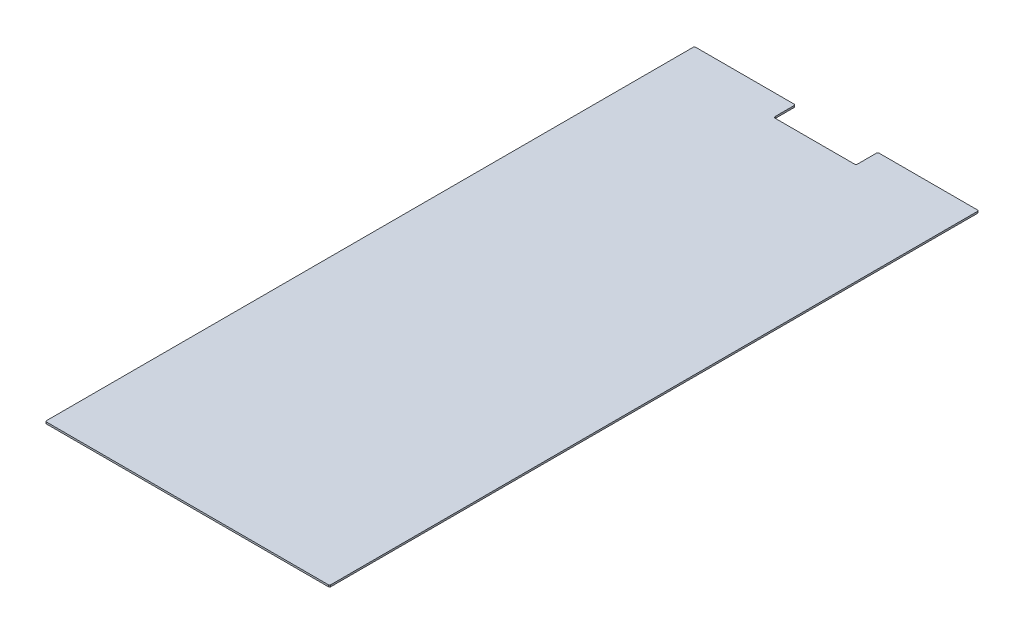
ISO-10303-21;
HEADER;
FILE_DESCRIPTION(('STEP AP214'),'2;1');
FILE_NAME('part.step','',(''),(''),'','','');
FILE_SCHEMA(('AUTOMOTIVE_DESIGN { 1 0 10303 214 1 1 1 1 }'));
ENDSEC;
DATA;
#1=APPLICATION_CONTEXT('core data for automotive mechanical design processes');
#2=APPLICATION_PROTOCOL_DEFINITION('international standard','automotive_design',2000,#1);
#3=PRODUCT_CONTEXT('',#1,'mechanical');
#4=PRODUCT('Part','Part','',(#3));
#5=PRODUCT_RELATED_PRODUCT_CATEGORY('part','',(#4));
#6=PRODUCT_DEFINITION_FORMATION('','',#4);
#7=PRODUCT_DEFINITION_CONTEXT('part definition',#1,'design');
#8=PRODUCT_DEFINITION('design','',#6,#7);
#9=PRODUCT_DEFINITION_SHAPE('','',#8);
#10=(LENGTH_UNIT() NAMED_UNIT(*) SI_UNIT(.MILLI.,.METRE.));
#11=(NAMED_UNIT(*) PLANE_ANGLE_UNIT() SI_UNIT($,.RADIAN.));
#12=(NAMED_UNIT(*) SI_UNIT($,.STERADIAN.) SOLID_ANGLE_UNIT());
#13=UNCERTAINTY_MEASURE_WITH_UNIT(LENGTH_MEASURE(1.E-05),#10,'distance_accuracy_value','');
#14=(GEOMETRIC_REPRESENTATION_CONTEXT(3) GLOBAL_UNCERTAINTY_ASSIGNED_CONTEXT((#13)) GLOBAL_UNIT_ASSIGNED_CONTEXT((#10,
#11,#12)) REPRESENTATION_CONTEXT('',''));
#15=CARTESIAN_POINT('',(0.,0.,0.));
#16=DIRECTION('',(0.,0.,1.));
#17=DIRECTION('',(1.,0.,0.));
#18=AXIS2_PLACEMENT_3D('',#15,#16,#17);
#19=CARTESIAN_POINT('',(-67.,3.,-517.5));
#20=DIRECTION('',(0.,-1.,0.));
#21=DIRECTION('',(0.,0.,-1.));
#22=AXIS2_PLACEMENT_3D('',#19,#20,#21);
#23=CYLINDRICAL_SURFACE('',#22,3.);
#24=CARTESIAN_POINT('',(-67.,0.,-517.5));
#25=DIRECTION('',(0.,-1.,0.));
#26=DIRECTION('',(0.,0.,-1.));
#27=AXIS2_PLACEMENT_3D('',#24,#25,#26);
#28=CIRCLE('',#27,3.);
#29=CARTESIAN_POINT('',(-67.,0.,-514.5));
#30=VERTEX_POINT('',#29);
#31=CARTESIAN_POINT('',(-70.,0.,-517.5));
#32=VERTEX_POINT('',#31);
#33=EDGE_CURVE('E326',#30,#32,#28,.T.);
#34=ORIENTED_EDGE('',*,*,#33,.T.);
#35=DIRECTION('',(0.,-1.,0.));
#36=VECTOR('',#35,1.);
#37=CARTESIAN_POINT('',(-70.,3.,-517.5));
#38=LINE('',#37,#36);
#39=CARTESIAN_POINT('',(-70.,3.,-517.5));
#40=VERTEX_POINT('',#39);
#41=EDGE_CURVE('E12',#40,#32,#38,.T.);
#42=ORIENTED_EDGE('',*,*,#41,.F.);
#43=CARTESIAN_POINT('',(-67.,3.,-517.5));
#44=DIRECTION('',(0.,-1.,0.));
#45=DIRECTION('',(0.,0.,-1.));
#46=AXIS2_PLACEMENT_3D('',#43,#44,#45);
#47=CIRCLE('',#46,3.);
#48=CARTESIAN_POINT('',(-67.,3.,-514.5));
#49=VERTEX_POINT('',#48);
#50=EDGE_CURVE('E248',#49,#40,#47,.T.);
#51=ORIENTED_EDGE('',*,*,#50,.F.);
#52=DIRECTION('',(0.,-1.,0.));
#53=VECTOR('',#52,1.);
#54=CARTESIAN_POINT('',(-67.,3.,-514.5));
#55=LINE('',#54,#53);
#56=EDGE_CURVE('E185',#49,#30,#55,.T.);
#57=ORIENTED_EDGE('',*,*,#56,.T.);
#58=EDGE_LOOP('',(#34,#42,#51,#57));
#59=FACE_BOUND('',#58,.T.);
#60=ADVANCED_FACE('F40',(#59),#23,.F.);
#61=CARTESIAN_POINT('',(-70.,3.,-517.5));
#62=DIRECTION('',(-1.,0.,0.));
#63=DIRECTION('',(0.,0.,1.));
#64=AXIS2_PLACEMENT_3D('',#61,#62,#63);
#65=PLANE('',#64);
#66=DIRECTION('',(0.,0.,-1.));
#67=VECTOR('',#66,1.);
#68=CARTESIAN_POINT('',(-70.,0.,-517.5));
#69=LINE('',#68,#67);
#70=CARTESIAN_POINT('',(-70.,0.,-549.5));
#71=VERTEX_POINT('',#70);
#72=EDGE_CURVE('E317',#32,#71,#69,.T.);
#73=ORIENTED_EDGE('',*,*,#72,.T.);
#74=DIRECTION('',(0.,-1.,0.));
#75=VECTOR('',#74,1.);
#76=CARTESIAN_POINT('',(-70.,3.,-549.5));
#77=LINE('',#76,#75);
#78=CARTESIAN_POINT('',(-70.,3.,-549.5));
#79=VERTEX_POINT('',#78);
#80=EDGE_CURVE('E49',#79,#71,#77,.T.);
#81=ORIENTED_EDGE('',*,*,#80,.F.);
#82=DIRECTION('',(0.,0.,-1.));
#83=VECTOR('',#82,1.);
#84=CARTESIAN_POINT('',(-70.,3.,-517.5));
#85=LINE('',#84,#83);
#86=EDGE_CURVE('E124',#40,#79,#85,.T.);
#87=ORIENTED_EDGE('',*,*,#86,.F.);
#88=ORIENTED_EDGE('',*,*,#41,.T.);
#89=EDGE_LOOP('',(#73,#81,#87,#88));
#90=FACE_BOUND('',#89,.T.);
#91=ADVANCED_FACE('F374',(#90),#65,.F.);
#92=CARTESIAN_POINT('',(-72.,3.,-549.5));
#93=DIRECTION('',(0.,-1.,0.));
#94=DIRECTION('',(0.,0.,-1.));
#95=AXIS2_PLACEMENT_3D('',#92,#93,#94);
#96=CYLINDRICAL_SURFACE('',#95,2.);
#97=CARTESIAN_POINT('',(-72.,0.,-549.5));
#98=DIRECTION('',(0.,1.,0.));
#99=DIRECTION('',(0.,0.,1.));
#100=AXIS2_PLACEMENT_3D('',#97,#98,#99);
#101=CIRCLE('',#100,2.);
#102=CARTESIAN_POINT('',(-72.,0.,-551.5));
#103=VERTEX_POINT('',#102);
#104=EDGE_CURVE('E312',#71,#103,#101,.T.);
#105=ORIENTED_EDGE('',*,*,#104,.T.);
#106=DIRECTION('',(0.,-1.,0.));
#107=VECTOR('',#106,1.);
#108=CARTESIAN_POINT('',(-72.,3.,-551.5));
#109=LINE('',#108,#107);
#110=CARTESIAN_POINT('',(-72.,3.,-551.5));
#111=VERTEX_POINT('',#110);
#112=EDGE_CURVE('E302',#111,#103,#109,.T.);
#113=ORIENTED_EDGE('',*,*,#112,.F.);
#114=CARTESIAN_POINT('',(-72.,3.,-549.5));
#115=DIRECTION('',(0.,1.,0.));
#116=DIRECTION('',(0.,0.,1.));
#117=AXIS2_PLACEMENT_3D('',#114,#115,#116);
#118=CIRCLE('',#117,2.);
#119=EDGE_CURVE('E240',#79,#111,#118,.T.);
#120=ORIENTED_EDGE('',*,*,#119,.F.);
#121=ORIENTED_EDGE('',*,*,#80,.T.);
#122=EDGE_LOOP('',(#105,#113,#120,#121));
#123=FACE_BOUND('',#122,.T.);
#124=ADVANCED_FACE('F310',(#123),#96,.T.);
#125=CARTESIAN_POINT('',(-72.,3.,-551.5));
#126=DIRECTION('',(0.,0.,1.));
#127=DIRECTION('',(1.,0.,0.));
#128=AXIS2_PLACEMENT_3D('',#125,#126,#127);
#129=PLANE('',#128);
#130=DIRECTION('',(-1.,0.,0.));
#131=VECTOR('',#130,1.);
#132=CARTESIAN_POINT('',(-72.,0.,-551.5));
#133=LINE('',#132,#131);
#134=CARTESIAN_POINT('',(-239.5,0.,-551.5));
#135=VERTEX_POINT('',#134);
#136=EDGE_CURVE('E319',#103,#135,#133,.T.);
#137=ORIENTED_EDGE('',*,*,#136,.T.);
#138=DIRECTION('',(0.,-1.,0.));
#139=VECTOR('',#138,1.);
#140=CARTESIAN_POINT('',(-239.5,3.,-551.5));
#141=LINE('',#140,#139);
#142=CARTESIAN_POINT('',(-239.5,3.,-551.5));
#143=VERTEX_POINT('',#142);
#144=EDGE_CURVE('E298',#143,#135,#141,.T.);
#145=ORIENTED_EDGE('',*,*,#144,.F.);
#146=DIRECTION('',(-1.,0.,0.));
#147=VECTOR('',#146,1.);
#148=CARTESIAN_POINT('',(-72.,3.,-551.5));
#149=LINE('',#148,#147);
#150=EDGE_CURVE('E236',#111,#143,#149,.T.);
#151=ORIENTED_EDGE('',*,*,#150,.F.);
#152=ORIENTED_EDGE('',*,*,#112,.T.);
#153=EDGE_LOOP('',(#137,#145,#151,#152));
#154=FACE_BOUND('',#153,.T.);
#155=ADVANCED_FACE('F381',(#154),#129,.F.);
#156=CARTESIAN_POINT('',(-239.5,3.,-549.5));
#157=DIRECTION('',(0.,-1.,0.));
#158=DIRECTION('',(0.,0.,-1.));
#159=AXIS2_PLACEMENT_3D('',#156,#157,#158);
#160=CYLINDRICAL_SURFACE('',#159,2.);
#161=CARTESIAN_POINT('',(-239.5,0.,-549.5));
#162=DIRECTION('',(0.,1.,0.));
#163=DIRECTION('',(0.,0.,1.));
#164=AXIS2_PLACEMENT_3D('',#161,#162,#163);
#165=CIRCLE('',#164,2.);
#166=CARTESIAN_POINT('',(-241.5,0.,-549.5));
#167=VERTEX_POINT('',#166);
#168=EDGE_CURVE('E324',#135,#167,#165,.T.);
#169=ORIENTED_EDGE('',*,*,#168,.T.);
#170=DIRECTION('',(0.,-1.,0.));
#171=VECTOR('',#170,1.);
#172=CARTESIAN_POINT('',(-241.5,3.,-549.5));
#173=LINE('',#172,#171);
#174=CARTESIAN_POINT('',(-241.5,3.,-549.5));
#175=VERTEX_POINT('',#174);
#176=EDGE_CURVE('E294',#175,#167,#173,.T.);
#177=ORIENTED_EDGE('',*,*,#176,.F.);
#178=CARTESIAN_POINT('',(-239.5,3.,-549.5));
#179=DIRECTION('',(0.,1.,0.));
#180=DIRECTION('',(0.,0.,1.));
#181=AXIS2_PLACEMENT_3D('',#178,#179,#180);
#182=CIRCLE('',#181,2.);
#183=EDGE_CURVE('E233',#143,#175,#182,.T.);
#184=ORIENTED_EDGE('',*,*,#183,.F.);
#185=ORIENTED_EDGE('',*,*,#144,.T.);
#186=EDGE_LOOP('',(#169,#177,#184,#185));
#187=FACE_BOUND('',#186,.T.);
#188=ADVANCED_FACE('F386',(#187),#160,.T.);
#189=CARTESIAN_POINT('',(-241.5,3.,-549.5));
#190=DIRECTION('',(1.,0.,0.));
#191=DIRECTION('',(0.,0.,-1.));
#192=AXIS2_PLACEMENT_3D('',#189,#190,#191);
#193=PLANE('',#192);
#194=DIRECTION('',(0.,0.,1.));
#195=VECTOR('',#194,1.);
#196=CARTESIAN_POINT('',(-241.5,0.,-549.5));
#197=LINE('',#196,#195);
#198=CARTESIAN_POINT('',(-241.5,0.,549.5));
#199=VERTEX_POINT('',#198);
#200=EDGE_CURVE('E331',#167,#199,#197,.T.);
#201=ORIENTED_EDGE('',*,*,#200,.T.);
#202=DIRECTION('',(0.,-1.,0.));
#203=VECTOR('',#202,1.);
#204=CARTESIAN_POINT('',(-241.5,3.,549.5));
#205=LINE('',#204,#203);
#206=CARTESIAN_POINT('',(-241.5,3.,549.5));
#207=VERTEX_POINT('',#206);
#208=EDGE_CURVE('E290',#207,#199,#205,.T.);
#209=ORIENTED_EDGE('',*,*,#208,.F.);
#210=DIRECTION('',(0.,0.,1.));
#211=VECTOR('',#210,1.);
#212=CARTESIAN_POINT('',(-241.5,3.,-549.5));
#213=LINE('',#212,#211);
#214=EDGE_CURVE('E225',#175,#207,#213,.T.);
#215=ORIENTED_EDGE('',*,*,#214,.F.);
#216=ORIENTED_EDGE('',*,*,#176,.T.);
#217=EDGE_LOOP('',(#201,#209,#215,#216));
#218=FACE_BOUND('',#217,.T.);
#219=ADVANCED_FACE('F390',(#218),#193,.F.);
#220=CARTESIAN_POINT('',(-239.5,3.,549.5));
#221=DIRECTION('',(0.,-1.,0.));
#222=DIRECTION('',(0.,0.,-1.));
#223=AXIS2_PLACEMENT_3D('',#220,#221,#222);
#224=CYLINDRICAL_SURFACE('',#223,2.);
#225=CARTESIAN_POINT('',(-239.5,0.,549.5));
#226=DIRECTION('',(0.,1.,0.));
#227=DIRECTION('',(0.,0.,-1.));
#228=AXIS2_PLACEMENT_3D('',#225,#226,#227);
#229=CIRCLE('',#228,2.);
#230=CARTESIAN_POINT('',(-239.5,0.,551.5));
#231=VERTEX_POINT('',#230);
#232=EDGE_CURVE('E334',#199,#231,#229,.T.);
#233=ORIENTED_EDGE('',*,*,#232,.T.);
#234=DIRECTION('',(0.,-1.,0.));
#235=VECTOR('',#234,1.);
#236=CARTESIAN_POINT('',(-239.5,3.,551.5));
#237=LINE('',#236,#235);
#238=CARTESIAN_POINT('',(-239.5,3.,551.5));
#239=VERTEX_POINT('',#238);
#240=EDGE_CURVE('E286',#239,#231,#237,.T.);
#241=ORIENTED_EDGE('',*,*,#240,.F.);
#242=CARTESIAN_POINT('',(-239.5,3.,549.5));
#243=DIRECTION('',(0.,1.,0.));
#244=DIRECTION('',(0.,0.,-1.));
#245=AXIS2_PLACEMENT_3D('',#242,#243,#244);
#246=CIRCLE('',#245,2.);
#247=EDGE_CURVE('E221',#207,#239,#246,.T.);
#248=ORIENTED_EDGE('',*,*,#247,.F.);
#249=ORIENTED_EDGE('',*,*,#208,.T.);
#250=EDGE_LOOP('',(#233,#241,#248,#249));
#251=FACE_BOUND('',#250,.T.);
#252=ADVANCED_FACE('F394',(#251),#224,.T.);
#253=CARTESIAN_POINT('',(-239.5,3.,551.5));
#254=DIRECTION('',(0.,0.,-1.));
#255=DIRECTION('',(-1.,0.,0.));
#256=AXIS2_PLACEMENT_3D('',#253,#254,#255);
#257=PLANE('',#256);
#258=DIRECTION('',(1.,0.,0.));
#259=VECTOR('',#258,1.);
#260=CARTESIAN_POINT('',(-239.5,0.,551.5));
#261=LINE('',#260,#259);
#262=CARTESIAN_POINT('',(239.5,0.,551.5));
#263=VERTEX_POINT('',#262);
#264=EDGE_CURVE('E337',#231,#263,#261,.T.);
#265=ORIENTED_EDGE('',*,*,#264,.T.);
#266=DIRECTION('',(0.,-1.,0.));
#267=VECTOR('',#266,1.);
#268=CARTESIAN_POINT('',(239.5,3.,551.5));
#269=LINE('',#268,#267);
#270=CARTESIAN_POINT('',(239.5,3.,551.5));
#271=VERTEX_POINT('',#270);
#272=EDGE_CURVE('E282',#271,#263,#269,.T.);
#273=ORIENTED_EDGE('',*,*,#272,.F.);
#274=DIRECTION('',(1.,0.,0.));
#275=VECTOR('',#274,1.);
#276=CARTESIAN_POINT('',(-239.5,3.,551.5));
#277=LINE('',#276,#275);
#278=EDGE_CURVE('E217',#239,#271,#277,.T.);
#279=ORIENTED_EDGE('',*,*,#278,.F.);
#280=ORIENTED_EDGE('',*,*,#240,.T.);
#281=EDGE_LOOP('',(#265,#273,#279,#280));
#282=FACE_BOUND('',#281,.T.);
#283=ADVANCED_FACE('F398',(#282),#257,.F.);
#284=CARTESIAN_POINT('',(239.5,3.,549.5));
#285=DIRECTION('',(0.,-1.,0.));
#286=DIRECTION('',(0.,0.,-1.));
#287=AXIS2_PLACEMENT_3D('',#284,#285,#286);
#288=CYLINDRICAL_SURFACE('',#287,2.);
#289=CARTESIAN_POINT('',(239.5,0.,549.5));
#290=DIRECTION('',(0.,1.,0.));
#291=DIRECTION('',(0.,0.,1.));
#292=AXIS2_PLACEMENT_3D('',#289,#290,#291);
#293=CIRCLE('',#292,2.);
#294=CARTESIAN_POINT('',(241.5,0.,549.5));
#295=VERTEX_POINT('',#294);
#296=EDGE_CURVE('E340',#263,#295,#293,.T.);
#297=ORIENTED_EDGE('',*,*,#296,.T.);
#298=DIRECTION('',(0.,-1.,0.));
#299=VECTOR('',#298,1.);
#300=CARTESIAN_POINT('',(241.5,3.,549.5));
#301=LINE('',#300,#299);
#302=CARTESIAN_POINT('',(241.5,3.,549.5));
#303=VERTEX_POINT('',#302);
#304=EDGE_CURVE('E278',#303,#295,#301,.T.);
#305=ORIENTED_EDGE('',*,*,#304,.F.);
#306=CARTESIAN_POINT('',(239.5,3.,549.5));
#307=DIRECTION('',(0.,1.,0.));
#308=DIRECTION('',(0.,0.,1.));
#309=AXIS2_PLACEMENT_3D('',#306,#307,#308);
#310=CIRCLE('',#309,2.);
#311=EDGE_CURVE('E214',#271,#303,#310,.T.);
#312=ORIENTED_EDGE('',*,*,#311,.F.);
#313=ORIENTED_EDGE('',*,*,#272,.T.);
#314=EDGE_LOOP('',(#297,#305,#312,#313));
#315=FACE_BOUND('',#314,.T.);
#316=ADVANCED_FACE('F402',(#315),#288,.T.);
#317=CARTESIAN_POINT('',(241.5,3.,549.5));
#318=DIRECTION('',(-1.,0.,0.));
#319=DIRECTION('',(0.,0.,1.));
#320=AXIS2_PLACEMENT_3D('',#317,#318,#319);
#321=PLANE('',#320);
#322=DIRECTION('',(0.,0.,-1.));
#323=VECTOR('',#322,1.);
#324=CARTESIAN_POINT('',(241.5,0.,549.5));
#325=LINE('',#324,#323);
#326=CARTESIAN_POINT('',(241.5,0.,-549.5));
#327=VERTEX_POINT('',#326);
#328=EDGE_CURVE('E343',#295,#327,#325,.T.);
#329=ORIENTED_EDGE('',*,*,#328,.T.);
#330=DIRECTION('',(0.,-1.,0.));
#331=VECTOR('',#330,1.);
#332=CARTESIAN_POINT('',(241.5,3.,-549.5));
#333=LINE('',#332,#331);
#334=CARTESIAN_POINT('',(241.5,3.,-549.5));
#335=VERTEX_POINT('',#334);
#336=EDGE_CURVE('E274',#335,#327,#333,.T.);
#337=ORIENTED_EDGE('',*,*,#336,.F.);
#338=DIRECTION('',(0.,0.,-1.));
#339=VECTOR('',#338,1.);
#340=CARTESIAN_POINT('',(241.5,3.,549.5));
#341=LINE('',#340,#339);
#342=EDGE_CURVE('E206',#303,#335,#341,.T.);
#343=ORIENTED_EDGE('',*,*,#342,.F.);
#344=ORIENTED_EDGE('',*,*,#304,.T.);
#345=EDGE_LOOP('',(#329,#337,#343,#344));
#346=FACE_BOUND('',#345,.T.);
#347=ADVANCED_FACE('F406',(#346),#321,.F.);
#348=CARTESIAN_POINT('',(239.5,3.,-549.5));
#349=DIRECTION('',(0.,-1.,0.));
#350=DIRECTION('',(0.,0.,-1.));
#351=AXIS2_PLACEMENT_3D('',#348,#349,#350);
#352=CYLINDRICAL_SURFACE('',#351,2.);
#353=CARTESIAN_POINT('',(239.5,0.,-549.5));
#354=DIRECTION('',(0.,1.,0.));
#355=DIRECTION('',(0.,0.,1.));
#356=AXIS2_PLACEMENT_3D('',#353,#354,#355);
#357=CIRCLE('',#356,2.);
#358=CARTESIAN_POINT('',(239.5,0.,-551.5));
#359=VERTEX_POINT('',#358);
#360=EDGE_CURVE('E346',#327,#359,#357,.T.);
#361=ORIENTED_EDGE('',*,*,#360,.T.);
#362=DIRECTION('',(0.,-1.,0.));
#363=VECTOR('',#362,1.);
#364=CARTESIAN_POINT('',(239.5,3.,-551.5));
#365=LINE('',#364,#363);
#366=CARTESIAN_POINT('',(239.5,3.,-551.5));
#367=VERTEX_POINT('',#366);
#368=EDGE_CURVE('E270',#367,#359,#365,.T.);
#369=ORIENTED_EDGE('',*,*,#368,.F.);
#370=CARTESIAN_POINT('',(239.5,3.,-549.5));
#371=DIRECTION('',(0.,1.,0.));
#372=DIRECTION('',(0.,0.,1.));
#373=AXIS2_PLACEMENT_3D('',#370,#371,#372);
#374=CIRCLE('',#373,2.);
#375=EDGE_CURVE('E202',#335,#367,#374,.T.);
#376=ORIENTED_EDGE('',*,*,#375,.F.);
#377=ORIENTED_EDGE('',*,*,#336,.T.);
#378=EDGE_LOOP('',(#361,#369,#376,#377));
#379=FACE_BOUND('',#378,.T.);
#380=ADVANCED_FACE('F410',(#379),#352,.T.);
#381=CARTESIAN_POINT('',(239.5,3.,-551.5));
#382=DIRECTION('',(0.,0.,1.));
#383=DIRECTION('',(1.,0.,0.));
#384=AXIS2_PLACEMENT_3D('',#381,#382,#383);
#385=PLANE('',#384);
#386=DIRECTION('',(-1.,0.,0.));
#387=VECTOR('',#386,1.);
#388=CARTESIAN_POINT('',(239.5,0.,-551.5));
#389=LINE('',#388,#387);
#390=CARTESIAN_POINT('',(72.,0.,-551.5));
#391=VERTEX_POINT('',#390);
#392=EDGE_CURVE('E349',#359,#391,#389,.T.);
#393=ORIENTED_EDGE('',*,*,#392,.T.);
#394=DIRECTION('',(0.,-1.,0.));
#395=VECTOR('',#394,1.);
#396=CARTESIAN_POINT('',(72.,3.,-551.5));
#397=LINE('',#396,#395);
#398=CARTESIAN_POINT('',(72.,3.,-551.5));
#399=VERTEX_POINT('',#398);
#400=EDGE_CURVE('E266',#399,#391,#397,.T.);
#401=ORIENTED_EDGE('',*,*,#400,.F.);
#402=DIRECTION('',(-1.,0.,0.));
#403=VECTOR('',#402,1.);
#404=CARTESIAN_POINT('',(239.5,3.,-551.5));
#405=LINE('',#404,#403);
#406=EDGE_CURVE('E198',#367,#399,#405,.T.);
#407=ORIENTED_EDGE('',*,*,#406,.F.);
#408=ORIENTED_EDGE('',*,*,#368,.T.);
#409=EDGE_LOOP('',(#393,#401,#407,#408));
#410=FACE_BOUND('',#409,.T.);
#411=ADVANCED_FACE('F414',(#410),#385,.F.);
#412=CARTESIAN_POINT('',(72.,3.,-549.5));
#413=DIRECTION('',(0.,-1.,0.));
#414=DIRECTION('',(0.,0.,-1.));
#415=AXIS2_PLACEMENT_3D('',#412,#413,#414);
#416=CYLINDRICAL_SURFACE('',#415,2.);
#417=CARTESIAN_POINT('',(72.,0.,-549.5));
#418=DIRECTION('',(0.,1.,0.));
#419=DIRECTION('',(0.,0.,1.));
#420=AXIS2_PLACEMENT_3D('',#417,#418,#419);
#421=CIRCLE('',#420,2.);
#422=CARTESIAN_POINT('',(70.,0.,-549.5));
#423=VERTEX_POINT('',#422);
#424=EDGE_CURVE('E352',#391,#423,#421,.T.);
#425=ORIENTED_EDGE('',*,*,#424,.T.);
#426=DIRECTION('',(0.,-1.,0.));
#427=VECTOR('',#426,1.);
#428=CARTESIAN_POINT('',(70.,3.,-549.5));
#429=LINE('',#428,#427);
#430=CARTESIAN_POINT('',(70.,3.,-549.5));
#431=VERTEX_POINT('',#430);
#432=EDGE_CURVE('E178',#431,#423,#429,.T.);
#433=ORIENTED_EDGE('',*,*,#432,.F.);
#434=CARTESIAN_POINT('',(72.,3.,-549.5));
#435=DIRECTION('',(0.,1.,0.));
#436=DIRECTION('',(0.,0.,1.));
#437=AXIS2_PLACEMENT_3D('',#434,#435,#436);
#438=CIRCLE('',#437,2.);
#439=EDGE_CURVE('E167',#399,#431,#438,.T.);
#440=ORIENTED_EDGE('',*,*,#439,.F.);
#441=ORIENTED_EDGE('',*,*,#400,.T.);
#442=EDGE_LOOP('',(#425,#433,#440,#441));
#443=FACE_BOUND('',#442,.T.);
#444=ADVANCED_FACE('F357',(#443),#416,.T.);
#445=CARTESIAN_POINT('',(70.,3.,-549.5));
#446=DIRECTION('',(1.,0.,0.));
#447=DIRECTION('',(0.,0.,-1.));
#448=AXIS2_PLACEMENT_3D('',#445,#446,#447);
#449=PLANE('',#448);
#450=DIRECTION('',(0.,0.,1.));
#451=VECTOR('',#450,1.);
#452=CARTESIAN_POINT('',(70.,0.,-549.5));
#453=LINE('',#452,#451);
#454=CARTESIAN_POINT('',(70.,0.,-517.5));
#455=VERTEX_POINT('',#454);
#456=EDGE_CURVE('E176',#423,#455,#453,.T.);
#457=ORIENTED_EDGE('',*,*,#456,.T.);
#458=DIRECTION('',(0.,-1.,0.));
#459=VECTOR('',#458,1.);
#460=CARTESIAN_POINT('',(70.,3.,-517.5));
#461=LINE('',#460,#459);
#462=CARTESIAN_POINT('',(70.,3.,-517.5));
#463=VERTEX_POINT('',#462);
#464=EDGE_CURVE('E173',#463,#455,#461,.T.);
#465=ORIENTED_EDGE('',*,*,#464,.F.);
#466=DIRECTION('',(0.,0.,1.));
#467=VECTOR('',#466,1.);
#468=CARTESIAN_POINT('',(70.,3.,-549.5));
#469=LINE('',#468,#467);
#470=EDGE_CURVE('E161',#431,#463,#469,.T.);
#471=ORIENTED_EDGE('',*,*,#470,.F.);
#472=ORIENTED_EDGE('',*,*,#432,.T.);
#473=EDGE_LOOP('',(#457,#465,#471,#472));
#474=FACE_BOUND('',#473,.T.);
#475=ADVANCED_FACE('F174',(#474),#449,.F.);
#476=CARTESIAN_POINT('',(67.,3.,-517.5));
#477=DIRECTION('',(0.,-1.,0.));
#478=DIRECTION('',(0.,0.,-1.));
#479=AXIS2_PLACEMENT_3D('',#476,#477,#478);
#480=CYLINDRICAL_SURFACE('',#479,3.);
#481=CARTESIAN_POINT('',(67.,0.,-517.5));
#482=DIRECTION('',(0.,-1.,0.));
#483=DIRECTION('',(0.,0.,-1.));
#484=AXIS2_PLACEMENT_3D('',#481,#482,#483);
#485=CIRCLE('',#484,3.);
#486=CARTESIAN_POINT('',(67.,0.,-514.5));
#487=VERTEX_POINT('',#486);
#488=EDGE_CURVE('E110',#455,#487,#485,.T.);
#489=ORIENTED_EDGE('',*,*,#488,.T.);
#490=DIRECTION('',(0.,-1.,0.));
#491=VECTOR('',#490,1.);
#492=CARTESIAN_POINT('',(67.,3.,-514.5));
#493=LINE('',#492,#491);
#494=CARTESIAN_POINT('',(67.,3.,-514.5));
#495=VERTEX_POINT('',#494);
#496=EDGE_CURVE('E179',#495,#487,#493,.T.);
#497=ORIENTED_EDGE('',*,*,#496,.F.);
#498=CARTESIAN_POINT('',(67.,3.,-517.5));
#499=DIRECTION('',(0.,-1.,0.));
#500=DIRECTION('',(0.,0.,-1.));
#501=AXIS2_PLACEMENT_3D('',#498,#499,#500);
#502=CIRCLE('',#501,3.);
#503=EDGE_CURVE('E165',#463,#495,#502,.T.);
#504=ORIENTED_EDGE('',*,*,#503,.F.);
#505=ORIENTED_EDGE('',*,*,#464,.T.);
#506=EDGE_LOOP('',(#489,#497,#504,#505));
#507=FACE_BOUND('',#506,.T.);
#508=ADVANCED_FACE('F181',(#507),#480,.F.);
#509=CARTESIAN_POINT('',(67.,3.,-514.5));
#510=DIRECTION('',(0.,0.,1.));
#511=DIRECTION('',(1.,0.,0.));
#512=AXIS2_PLACEMENT_3D('',#509,#510,#511);
#513=PLANE('',#512);
#514=DIRECTION('',(-1.,0.,0.));
#515=VECTOR('',#514,1.);
#516=CARTESIAN_POINT('',(67.,0.,-514.5));
#517=LINE('',#516,#515);
#518=EDGE_CURVE('E116',#487,#30,#517,.T.);
#519=ORIENTED_EDGE('',*,*,#518,.T.);
#520=ORIENTED_EDGE('',*,*,#56,.F.);
#521=DIRECTION('',(-1.,0.,0.));
#522=VECTOR('',#521,1.);
#523=CARTESIAN_POINT('',(67.,3.,-514.5));
#524=LINE('',#523,#522);
#525=EDGE_CURVE('E57',#495,#49,#524,.T.);
#526=ORIENTED_EDGE('',*,*,#525,.F.);
#527=ORIENTED_EDGE('',*,*,#496,.T.);
#528=EDGE_LOOP('',(#519,#520,#526,#527));
#529=FACE_BOUND('',#528,.T.);
#530=ADVANCED_FACE('F363',(#529),#513,.F.);
#531=CARTESIAN_POINT('',(-67.,3.,-517.5));
#532=DIRECTION('',(0.,-1.,0.));
#533=DIRECTION('',(0.,0.,-1.));
#534=AXIS2_PLACEMENT_3D('',#531,#532,#533);
#535=PLANE('',#534);
#536=ORIENTED_EDGE('',*,*,#50,.T.);
#537=ORIENTED_EDGE('',*,*,#86,.T.);
#538=ORIENTED_EDGE('',*,*,#119,.T.);
#539=ORIENTED_EDGE('',*,*,#150,.T.);
#540=ORIENTED_EDGE('',*,*,#183,.T.);
#541=ORIENTED_EDGE('',*,*,#214,.T.);
#542=ORIENTED_EDGE('',*,*,#247,.T.);
#543=ORIENTED_EDGE('',*,*,#278,.T.);
#544=ORIENTED_EDGE('',*,*,#311,.T.);
#545=ORIENTED_EDGE('',*,*,#342,.T.);
#546=ORIENTED_EDGE('',*,*,#375,.T.);
#547=ORIENTED_EDGE('',*,*,#406,.T.);
#548=ORIENTED_EDGE('',*,*,#439,.T.);
#549=ORIENTED_EDGE('',*,*,#470,.T.);
#550=ORIENTED_EDGE('',*,*,#503,.T.);
#551=ORIENTED_EDGE('',*,*,#525,.T.);
#552=EDGE_LOOP('',(#536,#537,#538,#539,#540,#541,#542,#543,#544,#545,#546,#547,#548,#549,#550,#551));
#553=FACE_BOUND('',#552,.T.);
#554=ADVANCED_FACE('F163',(#553),#535,.F.);
#555=CARTESIAN_POINT('',(-67.,0.,-517.5));
#556=DIRECTION('',(0.,-1.,0.));
#557=DIRECTION('',(0.,0.,-1.));
#558=AXIS2_PLACEMENT_3D('',#555,#556,#557);
#559=PLANE('',#558);
#560=ORIENTED_EDGE('',*,*,#33,.F.);
#561=ORIENTED_EDGE('',*,*,#518,.F.);
#562=ORIENTED_EDGE('',*,*,#488,.F.);
#563=ORIENTED_EDGE('',*,*,#456,.F.);
#564=ORIENTED_EDGE('',*,*,#424,.F.);
#565=ORIENTED_EDGE('',*,*,#392,.F.);
#566=ORIENTED_EDGE('',*,*,#360,.F.);
#567=ORIENTED_EDGE('',*,*,#328,.F.);
#568=ORIENTED_EDGE('',*,*,#296,.F.);
#569=ORIENTED_EDGE('',*,*,#264,.F.);
#570=ORIENTED_EDGE('',*,*,#232,.F.);
#571=ORIENTED_EDGE('',*,*,#200,.F.);
#572=ORIENTED_EDGE('',*,*,#168,.F.);
#573=ORIENTED_EDGE('',*,*,#136,.F.);
#574=ORIENTED_EDGE('',*,*,#104,.F.);
#575=ORIENTED_EDGE('',*,*,#72,.F.);
#576=EDGE_LOOP('',(#560,#561,#562,#563,#564,#565,#566,#567,#568,#569,#570,#571,#572,#573,#574,#575));
#577=FACE_BOUND('',#576,.T.);
#578=ADVANCED_FACE('F316',(#577),#559,.T.);
#579=CLOSED_SHELL('',(#60,#91,#124,#155,#188,#219,#252,#283,#316,#347,#380,#411,#444,#475,#508,
#530,#554,#578));
#580=MANIFOLD_SOLID_BREP('B2',#579);
#581=ADVANCED_BREP_SHAPE_REPRESENTATION('',(#18,#580),#14);
#582=SHAPE_DEFINITION_REPRESENTATION(#9,#581);
ENDSEC;
END-ISO-10303-21;
